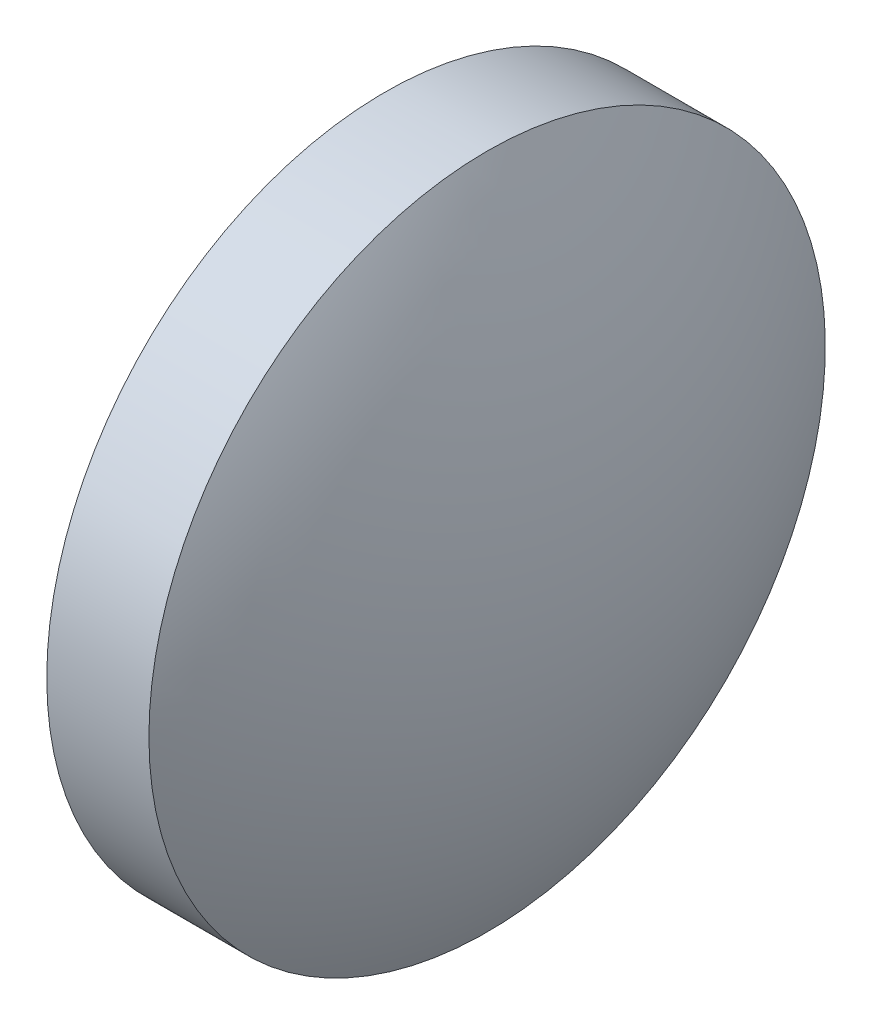
ISO-10303-21;
HEADER;
FILE_DESCRIPTION(('STEP AP214'),'2;1');
FILE_NAME('part.step','',(''),(''),'','','');
FILE_SCHEMA(('AUTOMOTIVE_DESIGN { 1 0 10303 214 1 1 1 1 }'));
ENDSEC;
DATA;
#1=APPLICATION_CONTEXT('core data for automotive mechanical design processes');
#2=APPLICATION_PROTOCOL_DEFINITION('international standard','automotive_design',2000,#1);
#3=PRODUCT_CONTEXT('',#1,'mechanical');
#4=PRODUCT('Part','Part','',(#3));
#5=PRODUCT_RELATED_PRODUCT_CATEGORY('part','',(#4));
#6=PRODUCT_DEFINITION_FORMATION('','',#4);
#7=PRODUCT_DEFINITION_CONTEXT('part definition',#1,'design');
#8=PRODUCT_DEFINITION('design','',#6,#7);
#9=PRODUCT_DEFINITION_SHAPE('','',#8);
#10=(LENGTH_UNIT() NAMED_UNIT(*) SI_UNIT(.MILLI.,.METRE.));
#11=(NAMED_UNIT(*) PLANE_ANGLE_UNIT() SI_UNIT($,.RADIAN.));
#12=(NAMED_UNIT(*) SI_UNIT($,.STERADIAN.) SOLID_ANGLE_UNIT());
#13=UNCERTAINTY_MEASURE_WITH_UNIT(LENGTH_MEASURE(1.E-05),#10,'distance_accuracy_value','');
#14=(GEOMETRIC_REPRESENTATION_CONTEXT(3) GLOBAL_UNCERTAINTY_ASSIGNED_CONTEXT((#13)) GLOBAL_UNIT_ASSIGNED_CONTEXT((#10,
#11,#12)) REPRESENTATION_CONTEXT('',''));
#15=CARTESIAN_POINT('',(0.,0.,0.));
#16=DIRECTION('',(0.,0.,1.));
#17=DIRECTION('',(1.,0.,0.));
#18=AXIS2_PLACEMENT_3D('',#15,#16,#17);
#19=CARTESIAN_POINT('',(572.974182789485,182.983404292995,0.));
#20=DIRECTION('',(-1.,0.,0.));
#21=DIRECTION('',(0.,1.,0.));
#22=AXIS2_PLACEMENT_3D('',#19,#20,#21);
#23=SPHERICAL_SURFACE('',#22,10.3349224806203);
#24=CARTESIAN_POINT('',(582.019105270106,182.983404292995,0.));
#25=DIRECTION('',(-1.,0.,0.));
#26=DIRECTION('',(0.,0.,1.));
#27=AXIS2_PLACEMENT_3D('',#24,#25,#26);
#28=CIRCLE('',#27,5.);
#29=CARTESIAN_POINT('',(582.019105270106,182.983404292995,5.));
#30=VERTEX_POINT('',#29);
#31=EDGE_CURVE('E10',#30,#30,#28,.T.);
#32=ORIENTED_EDGE('',*,*,#31,.F.);
#33=EDGE_LOOP('',(#32));
#34=FACE_BOUND('',#33,.T.);
#35=ADVANCED_FACE('F35',(#34),#23,.T.);
#36=CARTESIAN_POINT('',(579.277584696038,182.983404292995,0.));
#37=DIRECTION('',(-1.,0.,0.));
#38=DIRECTION('',(0.,0.,1.));
#39=AXIS2_PLACEMENT_3D('',#36,#37,#38);
#40=CYLINDRICAL_SURFACE('',#39,5.);
#41=CARTESIAN_POINT('',(580.509105270106,182.983404292995,0.));
#42=DIRECTION('',(-1.,0.,0.));
#43=DIRECTION('',(0.,0.,1.));
#44=AXIS2_PLACEMENT_3D('',#41,#42,#43);
#45=CIRCLE('',#44,5.);
#46=CARTESIAN_POINT('',(580.509105270106,182.983404292995,5.));
#47=VERTEX_POINT('',#46);
#48=EDGE_CURVE('E41',#47,#47,#45,.T.);
#49=ORIENTED_EDGE('',*,*,#48,.F.);
#50=EDGE_LOOP('',(#49));
#51=FACE_BOUND('',#50,.T.);
#52=ORIENTED_EDGE('',*,*,#31,.T.);
#53=EDGE_LOOP('',(#52));
#54=FACE_BOUND('',#53,.T.);
#55=ADVANCED_FACE('F49',(#51,#54),#40,.T.);
#56=CARTESIAN_POINT('',(580.509105270106,182.983404292995,0.));
#57=DIRECTION('',(1.,0.,0.));
#58=DIRECTION('',(0.,0.,-1.));
#59=AXIS2_PLACEMENT_3D('',#56,#57,#58);
#60=PLANE('',#59);
#61=ORIENTED_EDGE('',*,*,#48,.T.);
#62=EDGE_LOOP('',(#61));
#63=FACE_BOUND('',#62,.T.);
#64=ADVANCED_FACE('F47',(#63),#60,.F.);
#65=CLOSED_SHELL('',(#35,#55,#64));
#66=MANIFOLD_SOLID_BREP('B2',#65);
#67=ADVANCED_BREP_SHAPE_REPRESENTATION('',(#18,#66),#14);
#68=SHAPE_DEFINITION_REPRESENTATION(#9,#67);
ENDSEC;
END-ISO-10303-21;
